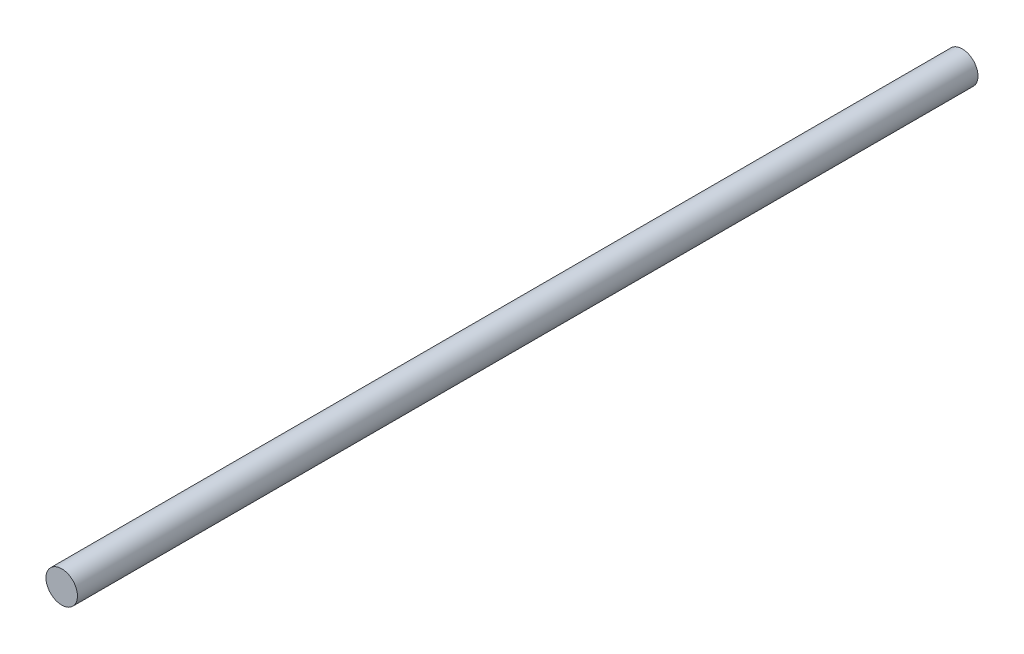
ISO-10303-21;
HEADER;
FILE_DESCRIPTION(('STEP AP214'),'2;1');
FILE_NAME('part.step','',(''),(''),'','','');
FILE_SCHEMA(('AUTOMOTIVE_DESIGN { 1 0 10303 214 1 1 1 1 }'));
ENDSEC;
DATA;
#1=APPLICATION_CONTEXT('core data for automotive mechanical design processes');
#2=APPLICATION_PROTOCOL_DEFINITION('international standard','automotive_design',2000,#1);
#3=PRODUCT_CONTEXT('',#1,'mechanical');
#4=PRODUCT('Part','Part','',(#3));
#5=PRODUCT_RELATED_PRODUCT_CATEGORY('part','',(#4));
#6=PRODUCT_DEFINITION_FORMATION('','',#4);
#7=PRODUCT_DEFINITION_CONTEXT('part definition',#1,'design');
#8=PRODUCT_DEFINITION('design','',#6,#7);
#9=PRODUCT_DEFINITION_SHAPE('','',#8);
#10=(LENGTH_UNIT() NAMED_UNIT(*) SI_UNIT(.MILLI.,.METRE.));
#11=(NAMED_UNIT(*) PLANE_ANGLE_UNIT() SI_UNIT($,.RADIAN.));
#12=(NAMED_UNIT(*) SI_UNIT($,.STERADIAN.) SOLID_ANGLE_UNIT());
#13=UNCERTAINTY_MEASURE_WITH_UNIT(LENGTH_MEASURE(1.E-05),#10,'distance_accuracy_value','');
#14=(GEOMETRIC_REPRESENTATION_CONTEXT(3) GLOBAL_UNCERTAINTY_ASSIGNED_CONTEXT((#13)) GLOBAL_UNIT_ASSIGNED_CONTEXT((#10,
#11,#12)) REPRESENTATION_CONTEXT('',''));
#15=CARTESIAN_POINT('',(0.,0.,0.));
#16=DIRECTION('',(0.,0.,1.));
#17=DIRECTION('',(1.,0.,0.));
#18=AXIS2_PLACEMENT_3D('',#15,#16,#17);
#19=CARTESIAN_POINT('',(0.,0.,286.));
#20=DIRECTION('',(0.,0.,-1.));
#21=DIRECTION('',(-1.,0.,0.));
#22=AXIS2_PLACEMENT_3D('',#19,#20,#21);
#23=CYLINDRICAL_SURFACE('',#22,5.);
#24=CARTESIAN_POINT('',(0.,0.,286.));
#25=DIRECTION('',(0.,0.,1.));
#26=DIRECTION('',(1.,0.,0.));
#27=AXIS2_PLACEMENT_3D('',#24,#25,#26);
#28=CIRCLE('',#27,5.);
#29=CARTESIAN_POINT('',(5.,0.,286.));
#30=VERTEX_POINT('',#29);
#31=EDGE_CURVE('E10',#30,#30,#28,.T.);
#32=ORIENTED_EDGE('',*,*,#31,.F.);
#33=EDGE_LOOP('',(#32));
#34=FACE_BOUND('',#33,.T.);
#35=CARTESIAN_POINT('',(0.,0.,0.));
#36=DIRECTION('',(0.,0.,1.));
#37=DIRECTION('',(1.,0.,0.));
#38=AXIS2_PLACEMENT_3D('',#35,#36,#37);
#39=CIRCLE('',#38,5.);
#40=CARTESIAN_POINT('',(5.,0.,0.));
#41=VERTEX_POINT('',#40);
#42=EDGE_CURVE('E37',#41,#41,#39,.T.);
#43=ORIENTED_EDGE('',*,*,#42,.T.);
#44=EDGE_LOOP('',(#43));
#45=FACE_BOUND('',#44,.T.);
#46=ADVANCED_FACE('F34',(#34,#45),#23,.T.);
#47=CARTESIAN_POINT('',(0.,0.,286.));
#48=DIRECTION('',(0.,0.,1.));
#49=DIRECTION('',(1.,0.,0.));
#50=AXIS2_PLACEMENT_3D('',#47,#48,#49);
#51=PLANE('',#50);
#52=ORIENTED_EDGE('',*,*,#31,.T.);
#53=EDGE_LOOP('',(#52));
#54=FACE_BOUND('',#53,.T.);
#55=ADVANCED_FACE('F49',(#54),#51,.T.);
#56=CARTESIAN_POINT('',(0.,0.,0.));
#57=DIRECTION('',(0.,0.,1.));
#58=DIRECTION('',(1.,0.,0.));
#59=AXIS2_PLACEMENT_3D('',#56,#57,#58);
#60=PLANE('',#59);
#61=ORIENTED_EDGE('',*,*,#42,.F.);
#62=EDGE_LOOP('',(#61));
#63=FACE_BOUND('',#62,.T.);
#64=ADVANCED_FACE('F47',(#63),#60,.F.);
#65=CLOSED_SHELL('',(#46,#55,#64));
#66=MANIFOLD_SOLID_BREP('B2',#65);
#67=ADVANCED_BREP_SHAPE_REPRESENTATION('',(#18,#66),#14);
#68=SHAPE_DEFINITION_REPRESENTATION(#9,#67);
ENDSEC;
END-ISO-10303-21;
